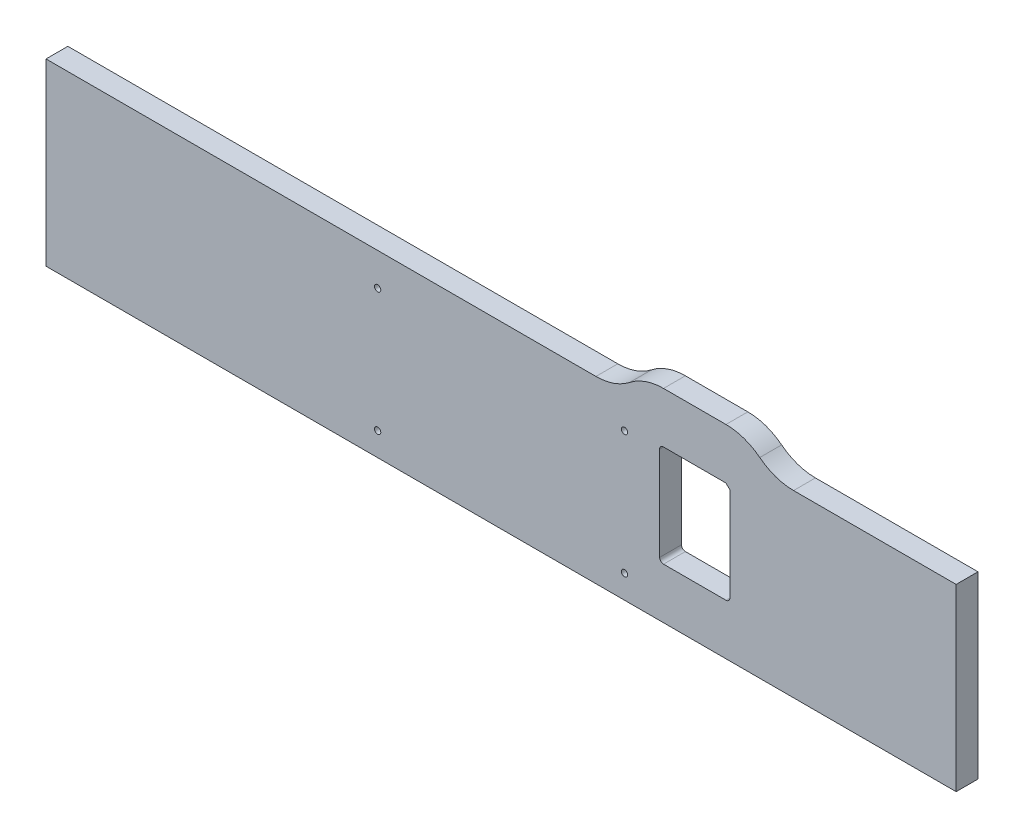
ISO-10303-21;
HEADER;
FILE_DESCRIPTION(('STEP AP214'),'2;1');
FILE_NAME('part.step','',(''),(''),'','','');
FILE_SCHEMA(('AUTOMOTIVE_DESIGN { 1 0 10303 214 1 1 1 1 }'));
ENDSEC;
DATA;
#1=APPLICATION_CONTEXT('core data for automotive mechanical design processes');
#2=APPLICATION_PROTOCOL_DEFINITION('international standard','automotive_design',2000,#1);
#3=PRODUCT_CONTEXT('',#1,'mechanical');
#4=PRODUCT('Part','Part','',(#3));
#5=PRODUCT_RELATED_PRODUCT_CATEGORY('part','',(#4));
#6=PRODUCT_DEFINITION_FORMATION('','',#4);
#7=PRODUCT_DEFINITION_CONTEXT('part definition',#1,'design');
#8=PRODUCT_DEFINITION('design','',#6,#7);
#9=PRODUCT_DEFINITION_SHAPE('','',#8);
#10=(LENGTH_UNIT() NAMED_UNIT(*) SI_UNIT(.MILLI.,.METRE.));
#11=(NAMED_UNIT(*) PLANE_ANGLE_UNIT() SI_UNIT($,.RADIAN.));
#12=(NAMED_UNIT(*) SI_UNIT($,.STERADIAN.) SOLID_ANGLE_UNIT());
#13=UNCERTAINTY_MEASURE_WITH_UNIT(LENGTH_MEASURE(1.E-05),#10,'distance_accuracy_value','');
#14=(GEOMETRIC_REPRESENTATION_CONTEXT(3) GLOBAL_UNCERTAINTY_ASSIGNED_CONTEXT((#13)) GLOBAL_UNIT_ASSIGNED_CONTEXT((#10,
#11,#12)) REPRESENTATION_CONTEXT('',''));
#15=CARTESIAN_POINT('',(0.,0.,0.));
#16=DIRECTION('',(0.,0.,1.));
#17=DIRECTION('',(1.,0.,0.));
#18=AXIS2_PLACEMENT_3D('',#15,#16,#17);
#19=CARTESIAN_POINT('',(137.160000000189,-5867.40000000055,-17.78));
#20=DIRECTION('',(1.,0.,0.));
#21=DIRECTION('',(0.,0.,-1.));
#22=AXIS2_PLACEMENT_3D('',#19,#20,#21);
#23=PLANE('',#22);
#24=DIRECTION('',(0.,1.,0.));
#25=VECTOR('',#24,1.);
#26=CARTESIAN_POINT('',(137.160000000189,-5867.40000000055,0.));
#27=LINE('',#26,#25);
#28=CARTESIAN_POINT('',(137.160000000189,-6013.45000000055,0.));
#29=VERTEX_POINT('',#28);
#30=CARTESIAN_POINT('',(137.160000000189,-5867.40000000055,0.));
#31=VERTEX_POINT('',#30);
#32=EDGE_CURVE('E232',#29,#31,#27,.T.);
#33=ORIENTED_EDGE('',*,*,#32,.F.);
#34=DIRECTION('',(0.,0.,1.));
#35=VECTOR('',#34,1.);
#36=CARTESIAN_POINT('',(137.160000000189,-6013.45000000055,-17.78));
#37=LINE('',#36,#35);
#38=CARTESIAN_POINT('',(137.160000000189,-6013.45000000055,-17.78));
#39=VERTEX_POINT('',#38);
#40=EDGE_CURVE('E11',#39,#29,#37,.T.);
#41=ORIENTED_EDGE('',*,*,#40,.F.);
#42=DIRECTION('',(0.,1.,0.));
#43=VECTOR('',#42,1.);
#44=CARTESIAN_POINT('',(137.160000000189,-5867.40000000055,-17.78));
#45=LINE('',#44,#43);
#46=CARTESIAN_POINT('',(137.160000000189,-5867.40000000055,-17.78));
#47=VERTEX_POINT('',#46);
#48=EDGE_CURVE('E233',#39,#47,#45,.T.);
#49=ORIENTED_EDGE('',*,*,#48,.T.);
#50=DIRECTION('',(0.,0.,1.));
#51=VECTOR('',#50,1.);
#52=CARTESIAN_POINT('',(137.160000000189,-5867.40000000055,-17.78));
#53=LINE('',#52,#51);
#54=EDGE_CURVE('E34',#47,#31,#53,.T.);
#55=ORIENTED_EDGE('',*,*,#54,.T.);
#56=EDGE_LOOP('',(#33,#41,#49,#55));
#57=FACE_BOUND('',#56,.T.);
#58=ADVANCED_FACE('F31',(#57),#23,.T.);
#59=CARTESIAN_POINT('',(137.160000000189,-6013.45000000055,-17.78));
#60=DIRECTION('',(0.,-1.,0.));
#61=DIRECTION('',(0.,0.,-1.));
#62=AXIS2_PLACEMENT_3D('',#59,#60,#61);
#63=PLANE('',#62);
#64=DIRECTION('',(1.,0.,0.));
#65=VECTOR('',#64,1.);
#66=CARTESIAN_POINT('',(137.160000000189,-6013.45000000055,0.));
#67=LINE('',#66,#65);
#68=CARTESIAN_POINT('',(-603.249999999811,-6013.45000000055,0.));
#69=VERTEX_POINT('',#68);
#70=EDGE_CURVE('E237',#69,#29,#67,.T.);
#71=ORIENTED_EDGE('',*,*,#70,.F.);
#72=DIRECTION('',(0.,0.,1.));
#73=VECTOR('',#72,1.);
#74=CARTESIAN_POINT('',(-603.249999999811,-6013.45000000055,-17.78));
#75=LINE('',#74,#73);
#76=CARTESIAN_POINT('',(-603.249999999811,-6013.45000000055,-17.78));
#77=VERTEX_POINT('',#76);
#78=EDGE_CURVE('E39',#77,#69,#75,.T.);
#79=ORIENTED_EDGE('',*,*,#78,.F.);
#80=DIRECTION('',(1.,0.,0.));
#81=VECTOR('',#80,1.);
#82=CARTESIAN_POINT('',(137.160000000189,-6013.45000000055,-17.78));
#83=LINE('',#82,#81);
#84=EDGE_CURVE('E261',#77,#39,#83,.T.);
#85=ORIENTED_EDGE('',*,*,#84,.T.);
#86=ORIENTED_EDGE('',*,*,#40,.T.);
#87=EDGE_LOOP('',(#71,#79,#85,#86));
#88=FACE_BOUND('',#87,.T.);
#89=ADVANCED_FACE('F317',(#88),#63,.T.);
#90=CARTESIAN_POINT('',(-603.249999999811,-6013.45000000055,-17.78));
#91=DIRECTION('',(-1.,0.,0.));
#92=DIRECTION('',(0.,0.,1.));
#93=AXIS2_PLACEMENT_3D('',#90,#91,#92);
#94=PLANE('',#93);
#95=DIRECTION('',(0.,-1.,0.));
#96=VECTOR('',#95,1.);
#97=CARTESIAN_POINT('',(-603.249999999811,-6013.45000000055,0.));
#98=LINE('',#97,#96);
#99=CARTESIAN_POINT('',(-603.249999999811,-5867.40000000055,0.));
#100=VERTEX_POINT('',#99);
#101=EDGE_CURVE('E287',#100,#69,#98,.T.);
#102=ORIENTED_EDGE('',*,*,#101,.F.);
#103=DIRECTION('',(0.,0.,1.));
#104=VECTOR('',#103,1.);
#105=CARTESIAN_POINT('',(-603.249999999811,-5867.40000000055,-17.78));
#106=LINE('',#105,#104);
#107=CARTESIAN_POINT('',(-603.249999999811,-5867.40000000055,-17.78));
#108=VERTEX_POINT('',#107);
#109=EDGE_CURVE('E293',#108,#100,#106,.T.);
#110=ORIENTED_EDGE('',*,*,#109,.F.);
#111=DIRECTION('',(0.,-1.,0.));
#112=VECTOR('',#111,1.);
#113=CARTESIAN_POINT('',(-603.249999999811,-6013.45000000055,-17.78));
#114=LINE('',#113,#112);
#115=EDGE_CURVE('E258',#108,#77,#114,.T.);
#116=ORIENTED_EDGE('',*,*,#115,.T.);
#117=ORIENTED_EDGE('',*,*,#78,.T.);
#118=EDGE_LOOP('',(#102,#110,#116,#117));
#119=FACE_BOUND('',#118,.T.);
#120=ADVANCED_FACE('F346',(#119),#94,.T.);
#121=CARTESIAN_POINT('',(-603.249999999811,-5867.40000000055,-17.78));
#122=DIRECTION('',(0.,1.,0.));
#123=DIRECTION('',(0.,0.,1.));
#124=AXIS2_PLACEMENT_3D('',#121,#122,#123);
#125=PLANE('',#124);
#126=DIRECTION('',(-1.,0.,0.));
#127=VECTOR('',#126,1.);
#128=CARTESIAN_POINT('',(-603.249999999811,-5867.40000000055,0.));
#129=LINE('',#128,#127);
#130=CARTESIAN_POINT('',(-155.878238141111,-5867.40000000055,0.));
#131=VERTEX_POINT('',#130);
#132=EDGE_CURVE('E284',#131,#100,#129,.T.);
#133=ORIENTED_EDGE('',*,*,#132,.F.);
#134=DIRECTION('',(0.,0.,1.));
#135=VECTOR('',#134,1.);
#136=CARTESIAN_POINT('',(-155.878238141111,-5867.40000000055,-17.78));
#137=LINE('',#136,#135);
#138=CARTESIAN_POINT('',(-155.878238141111,-5867.40000000055,-17.78));
#139=VERTEX_POINT('',#138);
#140=EDGE_CURVE('E295',#139,#131,#137,.T.);
#141=ORIENTED_EDGE('',*,*,#140,.F.);
#142=DIRECTION('',(-1.,0.,0.));
#143=VECTOR('',#142,1.);
#144=CARTESIAN_POINT('',(-603.249999999811,-5867.40000000055,-17.78));
#145=LINE('',#144,#143);
#146=EDGE_CURVE('E255',#139,#108,#145,.T.);
#147=ORIENTED_EDGE('',*,*,#146,.T.);
#148=ORIENTED_EDGE('',*,*,#109,.T.);
#149=EDGE_LOOP('',(#133,#141,#147,#148));
#150=FACE_BOUND('',#149,.T.);
#151=ADVANCED_FACE('F344',(#150),#125,.T.);
#152=CARTESIAN_POINT('',(-155.878238141111,-5822.95000000024,-17.78));
#153=DIRECTION('',(0.,0.,1.));
#154=DIRECTION('',(1.,0.,0.));
#155=AXIS2_PLACEMENT_3D('',#152,#153,#154);
#156=CYLINDRICAL_SURFACE('',#155,44.4500000003067);
#157=CARTESIAN_POINT('',(-155.878238141111,-5822.95000000024,0.));
#158=DIRECTION('',(0.,0.,-1.));
#159=DIRECTION('',(1.,0.,0.));
#160=AXIS2_PLACEMENT_3D('',#157,#158,#159);
#161=CIRCLE('',#160,44.4500000003067);
#162=CARTESIAN_POINT('',(-128.381931570133,-5857.87499999998,0.));
#163=VERTEX_POINT('',#162);
#164=EDGE_CURVE('E281',#163,#131,#161,.T.);
#165=ORIENTED_EDGE('',*,*,#164,.F.);
#166=DIRECTION('',(0.,0.,1.));
#167=VECTOR('',#166,1.);
#168=CARTESIAN_POINT('',(-128.381931570133,-5857.87499999998,-17.78));
#169=LINE('',#168,#167);
#170=CARTESIAN_POINT('',(-128.381931570133,-5857.87499999998,-17.78));
#171=VERTEX_POINT('',#170);
#172=EDGE_CURVE('E297',#171,#163,#169,.T.);
#173=ORIENTED_EDGE('',*,*,#172,.F.);
#174=CARTESIAN_POINT('',(-155.878238141111,-5822.95000000024,-17.78));
#175=DIRECTION('',(0.,0.,-1.));
#176=DIRECTION('',(1.,0.,0.));
#177=AXIS2_PLACEMENT_3D('',#174,#175,#176);
#178=CIRCLE('',#177,44.4500000003067);
#179=EDGE_CURVE('E252',#171,#139,#178,.T.);
#180=ORIENTED_EDGE('',*,*,#179,.T.);
#181=ORIENTED_EDGE('',*,*,#140,.T.);
#182=EDGE_LOOP('',(#165,#173,#180,#181));
#183=FACE_BOUND('',#182,.T.);
#184=ADVANCED_FACE('F340',(#183),#156,.F.);
#185=CARTESIAN_POINT('',(-100.885625,-5892.8,-17.78));
#186=DIRECTION('',(0.,0.,1.));
#187=DIRECTION('',(1.,0.,0.));
#188=AXIS2_PLACEMENT_3D('',#185,#186,#187);
#189=CYLINDRICAL_SURFACE('',#188,44.4500000000012);
#190=CARTESIAN_POINT('',(-100.885625,-5892.8,0.));
#191=DIRECTION('',(0.,0.,1.));
#192=DIRECTION('',(-1.,0.,0.));
#193=AXIS2_PLACEMENT_3D('',#190,#191,#192);
#194=CIRCLE('',#193,44.4500000000012);
#195=CARTESIAN_POINT('',(-100.885625,-5848.35,0.));
#196=VERTEX_POINT('',#195);
#197=EDGE_CURVE('E278',#196,#163,#194,.T.);
#198=ORIENTED_EDGE('',*,*,#197,.F.);
#199=DIRECTION('',(0.,0.,1.));
#200=VECTOR('',#199,1.);
#201=CARTESIAN_POINT('',(-100.885625,-5848.35,-17.78));
#202=LINE('',#201,#200);
#203=CARTESIAN_POINT('',(-100.885625,-5848.35,-17.78));
#204=VERTEX_POINT('',#203);
#205=EDGE_CURVE('E299',#204,#196,#202,.T.);
#206=ORIENTED_EDGE('',*,*,#205,.F.);
#207=CARTESIAN_POINT('',(-100.885625,-5892.8,-17.78));
#208=DIRECTION('',(0.,0.,1.));
#209=DIRECTION('',(-1.,0.,0.));
#210=AXIS2_PLACEMENT_3D('',#207,#208,#209);
#211=CIRCLE('',#210,44.4500000000012);
#212=EDGE_CURVE('E249',#204,#171,#211,.T.);
#213=ORIENTED_EDGE('',*,*,#212,.T.);
#214=ORIENTED_EDGE('',*,*,#172,.T.);
#215=EDGE_LOOP('',(#198,#206,#213,#214));
#216=FACE_BOUND('',#215,.T.);
#217=ADVANCED_FACE('F336',(#216),#189,.T.);
#218=CARTESIAN_POINT('',(-100.885625,-5848.35,-17.78));
#219=DIRECTION('',(0.,1.,0.));
#220=DIRECTION('',(0.,0.,1.));
#221=AXIS2_PLACEMENT_3D('',#218,#219,#220);
#222=PLANE('',#221);
#223=DIRECTION('',(-1.,0.,0.));
#224=VECTOR('',#223,1.);
#225=CARTESIAN_POINT('',(-100.885625,-5848.35,0.));
#226=LINE('',#225,#224);
#227=CARTESIAN_POINT('',(-50.085625,-5848.35,0.));
#228=VERTEX_POINT('',#227);
#229=EDGE_CURVE('E275',#228,#196,#226,.T.);
#230=ORIENTED_EDGE('',*,*,#229,.F.);
#231=DIRECTION('',(0.,0.,1.));
#232=VECTOR('',#231,1.);
#233=CARTESIAN_POINT('',(-50.085625,-5848.35,-17.78));
#234=LINE('',#233,#232);
#235=CARTESIAN_POINT('',(-50.085625,-5848.35,-17.78));
#236=VERTEX_POINT('',#235);
#237=EDGE_CURVE('E301',#236,#228,#234,.T.);
#238=ORIENTED_EDGE('',*,*,#237,.F.);
#239=DIRECTION('',(-1.,0.,0.));
#240=VECTOR('',#239,1.);
#241=CARTESIAN_POINT('',(-100.885625,-5848.35,-17.78));
#242=LINE('',#241,#240);
#243=EDGE_CURVE('E246',#236,#204,#242,.T.);
#244=ORIENTED_EDGE('',*,*,#243,.T.);
#245=ORIENTED_EDGE('',*,*,#205,.T.);
#246=EDGE_LOOP('',(#230,#238,#244,#245));
#247=FACE_BOUND('',#246,.T.);
#248=ADVANCED_FACE('F332',(#247),#222,.T.);
#249=CARTESIAN_POINT('',(-50.085625,-5892.8,-17.78));
#250=DIRECTION('',(0.,0.,1.));
#251=DIRECTION('',(1.,0.,0.));
#252=AXIS2_PLACEMENT_3D('',#249,#250,#251);
#253=CYLINDRICAL_SURFACE('',#252,44.450000000002);
#254=CARTESIAN_POINT('',(-50.085625,-5892.8,0.));
#255=DIRECTION('',(0.,0.,1.));
#256=DIRECTION('',(-1.,0.,0.));
#257=AXIS2_PLACEMENT_3D('',#254,#255,#256);
#258=CIRCLE('',#257,44.450000000002);
#259=CARTESIAN_POINT('',(-22.5893184298673,-5857.87499999998,0.));
#260=VERTEX_POINT('',#259);
#261=EDGE_CURVE('E272',#260,#228,#258,.T.);
#262=ORIENTED_EDGE('',*,*,#261,.F.);
#263=DIRECTION('',(0.,0.,1.));
#264=VECTOR('',#263,1.);
#265=CARTESIAN_POINT('',(-22.5893184298673,-5857.87499999998,-17.78));
#266=LINE('',#265,#264);
#267=CARTESIAN_POINT('',(-22.5893184298673,-5857.87499999998,-17.78));
#268=VERTEX_POINT('',#267);
#269=EDGE_CURVE('E303',#268,#260,#266,.T.);
#270=ORIENTED_EDGE('',*,*,#269,.F.);
#271=CARTESIAN_POINT('',(-50.085625,-5892.8,-17.78));
#272=DIRECTION('',(0.,0.,1.));
#273=DIRECTION('',(-1.,0.,0.));
#274=AXIS2_PLACEMENT_3D('',#271,#272,#273);
#275=CIRCLE('',#274,44.450000000002);
#276=EDGE_CURVE('E243',#268,#236,#275,.T.);
#277=ORIENTED_EDGE('',*,*,#276,.T.);
#278=ORIENTED_EDGE('',*,*,#237,.T.);
#279=EDGE_LOOP('',(#262,#270,#277,#278));
#280=FACE_BOUND('',#279,.T.);
#281=ADVANCED_FACE('F330',(#280),#253,.T.);
#282=CARTESIAN_POINT('',(4.90698814194757,-5822.94999999782,-17.78));
#283=DIRECTION('',(0.,0.,1.));
#284=DIRECTION('',(1.,0.,0.));
#285=AXIS2_PLACEMENT_3D('',#282,#283,#284);
#286=CYLINDRICAL_SURFACE('',#285,44.4500000027208);
#287=CARTESIAN_POINT('',(4.90698814194757,-5822.94999999782,0.));
#288=DIRECTION('',(0.,0.,-1.));
#289=DIRECTION('',(1.,0.,0.));
#290=AXIS2_PLACEMENT_3D('',#287,#288,#289);
#291=CIRCLE('',#290,44.4500000027208);
#292=CARTESIAN_POINT('',(4.90698814111107,-5867.40000000055,0.));
#293=VERTEX_POINT('',#292);
#294=EDGE_CURVE('E269',#293,#260,#291,.T.);
#295=ORIENTED_EDGE('',*,*,#294,.F.);
#296=DIRECTION('',(0.,0.,1.));
#297=VECTOR('',#296,1.);
#298=CARTESIAN_POINT('',(4.90698814111107,-5867.40000000055,-17.78));
#299=LINE('',#298,#297);
#300=CARTESIAN_POINT('',(4.90698814111107,-5867.40000000055,-17.78));
#301=VERTEX_POINT('',#300);
#302=EDGE_CURVE('E304',#301,#293,#299,.T.);
#303=ORIENTED_EDGE('',*,*,#302,.F.);
#304=CARTESIAN_POINT('',(4.90698814194757,-5822.94999999782,-17.78));
#305=DIRECTION('',(0.,0.,-1.));
#306=DIRECTION('',(1.,0.,0.));
#307=AXIS2_PLACEMENT_3D('',#304,#305,#306);
#308=CIRCLE('',#307,44.4500000027208);
#309=EDGE_CURVE('E240',#301,#268,#308,.T.);
#310=ORIENTED_EDGE('',*,*,#309,.T.);
#311=ORIENTED_EDGE('',*,*,#269,.T.);
#312=EDGE_LOOP('',(#295,#303,#310,#311));
#313=FACE_BOUND('',#312,.T.);
#314=ADVANCED_FACE('F326',(#313),#286,.F.);
#315=CARTESIAN_POINT('',(4.90698814111106,-5867.40000000055,-17.78));
#316=DIRECTION('',(0.,1.,0.));
#317=DIRECTION('',(0.,0.,1.));
#318=AXIS2_PLACEMENT_3D('',#315,#316,#317);
#319=PLANE('',#318);
#320=DIRECTION('',(-1.,0.,0.));
#321=VECTOR('',#320,1.);
#322=CARTESIAN_POINT('',(4.90698814111106,-5867.40000000055,0.));
#323=LINE('',#322,#321);
#324=EDGE_CURVE('E266',#31,#293,#323,.T.);
#325=ORIENTED_EDGE('',*,*,#324,.F.);
#326=ORIENTED_EDGE('',*,*,#54,.F.);
#327=DIRECTION('',(-1.,0.,0.));
#328=VECTOR('',#327,1.);
#329=CARTESIAN_POINT('',(4.90698814111106,-5867.40000000055,-17.78));
#330=LINE('',#329,#328);
#331=EDGE_CURVE('E236',#47,#301,#330,.T.);
#332=ORIENTED_EDGE('',*,*,#331,.T.);
#333=ORIENTED_EDGE('',*,*,#302,.T.);
#334=EDGE_LOOP('',(#325,#326,#332,#333));
#335=FACE_BOUND('',#334,.T.);
#336=ADVANCED_FACE('F312',(#335),#319,.T.);
#337=CARTESIAN_POINT('',(-155.878238141111,-5822.95000000024,-17.78));
#338=DIRECTION('',(0.,0.,1.));
#339=DIRECTION('',(1.,0.,0.));
#340=AXIS2_PLACEMENT_3D('',#337,#338,#339);
#341=PLANE('',#340);
#342=DIRECTION('',(1.,0.,0.));
#343=VECTOR('',#342,1.);
#344=CARTESIAN_POINT('',(-50.085625,-5889.625,-17.78));
#345=LINE('',#344,#343);
#346=CARTESIAN_POINT('',(-100.885625,-5889.625,-17.78));
#347=VERTEX_POINT('',#346);
#348=CARTESIAN_POINT('',(-50.0856249999997,-5889.625,-17.78));
#349=VERTEX_POINT('',#348);
#350=EDGE_CURVE('E571',#347,#349,#345,.T.);
#351=ORIENTED_EDGE('',*,*,#350,.F.);
#352=CARTESIAN_POINT('',(-100.885625,-5892.8,-17.78));
#353=DIRECTION('',(0.,0.,1.));
#354=DIRECTION('',(1.,0.,0.));
#355=AXIS2_PLACEMENT_3D('',#352,#353,#354);
#356=CIRCLE('',#355,3.1750000000003);
#357=CARTESIAN_POINT('',(-104.060625,-5892.8,-17.78));
#358=VERTEX_POINT('',#357);
#359=EDGE_CURVE('E208',#358,#347,#356,.F.);
#360=ORIENTED_EDGE('',*,*,#359,.F.);
#361=DIRECTION('',(0.,1.,0.));
#362=VECTOR('',#361,1.);
#363=CARTESIAN_POINT('',(-104.060625,-5892.8,-17.78));
#364=LINE('',#363,#362);
#365=CARTESIAN_POINT('',(-104.060625,-5969.,-17.78));
#366=VERTEX_POINT('',#365);
#367=EDGE_CURVE('E205',#366,#358,#364,.T.);
#368=ORIENTED_EDGE('',*,*,#367,.F.);
#369=CARTESIAN_POINT('',(-100.885624999999,-5969.,-17.78));
#370=DIRECTION('',(0.,0.,1.));
#371=DIRECTION('',(1.,0.,0.));
#372=AXIS2_PLACEMENT_3D('',#369,#370,#371);
#373=CIRCLE('',#372,3.17500000000059);
#374=CARTESIAN_POINT('',(-100.885625,-5972.175,-17.78));
#375=VERTEX_POINT('',#374);
#376=EDGE_CURVE('E162',#375,#366,#373,.F.);
#377=ORIENTED_EDGE('',*,*,#376,.F.);
#378=DIRECTION('',(-1.,0.,0.));
#379=VECTOR('',#378,1.);
#380=CARTESIAN_POINT('',(-100.885625,-5972.175,-17.78));
#381=LINE('',#380,#379);
#382=CARTESIAN_POINT('',(-50.085625,-5972.175,-17.78));
#383=VERTEX_POINT('',#382);
#384=EDGE_CURVE('E557',#383,#375,#381,.T.);
#385=ORIENTED_EDGE('',*,*,#384,.F.);
#386=CARTESIAN_POINT('',(-50.085625,-5969.,-17.78));
#387=DIRECTION('',(0.,0.,1.));
#388=DIRECTION('',(1.,0.,0.));
#389=AXIS2_PLACEMENT_3D('',#386,#387,#388);
#390=CIRCLE('',#389,3.17499999999986);
#391=CARTESIAN_POINT('',(-46.9106250000002,-5969.,-17.78));
#392=VERTEX_POINT('',#391);
#393=EDGE_CURVE('E559',#392,#383,#390,.F.);
#394=ORIENTED_EDGE('',*,*,#393,.F.);
#395=DIRECTION('',(0.,-1.,0.));
#396=VECTOR('',#395,1.);
#397=CARTESIAN_POINT('',(-46.910625,-5969.,-17.78));
#398=LINE('',#397,#396);
#399=CARTESIAN_POINT('',(-46.910625,-5892.8,-17.78));
#400=VERTEX_POINT('',#399);
#401=EDGE_CURVE('E567',#400,#392,#398,.T.);
#402=ORIENTED_EDGE('',*,*,#401,.F.);
#403=DIRECTION('',(0.707106781186581,-0.707106781186514,0.));
#404=VECTOR('',#403,1.);
#405=CARTESIAN_POINT('',(-46.910625,-5892.8,-17.78));
#406=LINE('',#405,#404);
#407=EDGE_CURVE('E569',#349,#400,#406,.T.);
#408=ORIENTED_EDGE('',*,*,#407,.F.);
#409=EDGE_LOOP('',(#351,#360,#368,#377,#385,#394,#402,#408));
#410=FACE_BOUND('',#409,.T.);
#411=CARTESIAN_POINT('',(-333.454375,-5894.07,-17.78));
#412=DIRECTION('',(0.,0.,1.));
#413=DIRECTION('',(1.,0.,0.));
#414=AXIS2_PLACEMENT_3D('',#411,#412,#413);
#415=CIRCLE('',#414,2.54000000000009);
#416=CARTESIAN_POINT('',(-330.914375,-5894.07,-17.78));
#417=VERTEX_POINT('',#416);
#418=EDGE_CURVE('E211',#417,#417,#415,.F.);
#419=ORIENTED_EDGE('',*,*,#418,.F.);
#420=EDGE_LOOP('',(#419));
#421=FACE_BOUND('',#420,.T.);
#422=CARTESIAN_POINT('',(-132.635625,-5894.07,-17.78));
#423=DIRECTION('',(0.,0.,1.));
#424=DIRECTION('',(1.,0.,0.));
#425=AXIS2_PLACEMENT_3D('',#422,#423,#424);
#426=CIRCLE('',#425,2.5399999999999);
#427=CARTESIAN_POINT('',(-130.095625,-5894.07,-17.78));
#428=VERTEX_POINT('',#427);
#429=EDGE_CURVE('E217',#428,#428,#426,.F.);
#430=ORIENTED_EDGE('',*,*,#429,.F.);
#431=EDGE_LOOP('',(#430));
#432=FACE_BOUND('',#431,.T.);
#433=CARTESIAN_POINT('',(-132.635625,-5994.4,-17.78));
#434=DIRECTION('',(0.,0.,1.));
#435=DIRECTION('',(1.,0.,0.));
#436=AXIS2_PLACEMENT_3D('',#433,#434,#435);
#437=CIRCLE('',#436,2.53999999999974);
#438=CARTESIAN_POINT('',(-130.095625,-5994.4,-17.78));
#439=VERTEX_POINT('',#438);
#440=EDGE_CURVE('E223',#439,#439,#437,.F.);
#441=ORIENTED_EDGE('',*,*,#440,.F.);
#442=EDGE_LOOP('',(#441));
#443=FACE_BOUND('',#442,.T.);
#444=CARTESIAN_POINT('',(-333.454375,-5994.4,-17.78));
#445=DIRECTION('',(0.,0.,1.));
#446=DIRECTION('',(1.,0.,0.));
#447=AXIS2_PLACEMENT_3D('',#444,#445,#446);
#448=CIRCLE('',#447,2.53999999999993);
#449=CARTESIAN_POINT('',(-330.914375,-5994.4,-17.78));
#450=VERTEX_POINT('',#449);
#451=EDGE_CURVE('E229',#450,#450,#448,.F.);
#452=ORIENTED_EDGE('',*,*,#451,.F.);
#453=EDGE_LOOP('',(#452));
#454=FACE_BOUND('',#453,.T.);
#455=ORIENTED_EDGE('',*,*,#48,.F.);
#456=ORIENTED_EDGE('',*,*,#84,.F.);
#457=ORIENTED_EDGE('',*,*,#115,.F.);
#458=ORIENTED_EDGE('',*,*,#146,.F.);
#459=ORIENTED_EDGE('',*,*,#179,.F.);
#460=ORIENTED_EDGE('',*,*,#212,.F.);
#461=ORIENTED_EDGE('',*,*,#243,.F.);
#462=ORIENTED_EDGE('',*,*,#276,.F.);
#463=ORIENTED_EDGE('',*,*,#309,.F.);
#464=ORIENTED_EDGE('',*,*,#331,.F.);
#465=EDGE_LOOP('',(#455,#456,#457,#458,#459,#460,#461,#462,#463,#464));
#466=FACE_BOUND('',#465,.T.);
#467=ADVANCED_FACE('F320',(#410,#421,#432,#443,#454,#466),#341,.F.);
#468=CARTESIAN_POINT('',(-155.878238141111,-5822.95000000024,0.));
#469=DIRECTION('',(0.,0.,1.));
#470=DIRECTION('',(1.,0.,0.));
#471=AXIS2_PLACEMENT_3D('',#468,#469,#470);
#472=PLANE('',#471);
#473=CARTESIAN_POINT('',(-100.885625,-5892.8,0.));
#474=DIRECTION('',(0.,0.,1.));
#475=DIRECTION('',(1.,0.,0.));
#476=AXIS2_PLACEMENT_3D('',#473,#474,#475);
#477=CIRCLE('',#476,3.1750000000003);
#478=CARTESIAN_POINT('',(-100.885625,-5889.625,0.));
#479=VERTEX_POINT('',#478);
#480=CARTESIAN_POINT('',(-104.060625,-5892.8,0.));
#481=VERTEX_POINT('',#480);
#482=EDGE_CURVE('E55',#479,#481,#477,.T.);
#483=ORIENTED_EDGE('',*,*,#482,.F.);
#484=DIRECTION('',(-1.,0.,0.));
#485=VECTOR('',#484,1.);
#486=CARTESIAN_POINT('',(-50.085625,-5889.625,0.));
#487=LINE('',#486,#485);
#488=CARTESIAN_POINT('',(-50.085625,-5889.625,0.));
#489=VERTEX_POINT('',#488);
#490=EDGE_CURVE('E190',#489,#479,#487,.T.);
#491=ORIENTED_EDGE('',*,*,#490,.F.);
#492=DIRECTION('',(-0.707106781186581,0.707106781186514,0.));
#493=VECTOR('',#492,1.);
#494=CARTESIAN_POINT('',(-46.910625,-5892.8,0.));
#495=LINE('',#494,#493);
#496=CARTESIAN_POINT('',(-46.910625,-5892.8,0.));
#497=VERTEX_POINT('',#496);
#498=EDGE_CURVE('E187',#497,#489,#495,.T.);
#499=ORIENTED_EDGE('',*,*,#498,.F.);
#500=DIRECTION('',(0.,1.,0.));
#501=VECTOR('',#500,1.);
#502=CARTESIAN_POINT('',(-46.910625,-5969.,0.));
#503=LINE('',#502,#501);
#504=CARTESIAN_POINT('',(-46.9106250000002,-5969.,0.));
#505=VERTEX_POINT('',#504);
#506=EDGE_CURVE('E184',#505,#497,#503,.T.);
#507=ORIENTED_EDGE('',*,*,#506,.F.);
#508=CARTESIAN_POINT('',(-50.085625,-5969.,0.));
#509=DIRECTION('',(0.,0.,1.));
#510=DIRECTION('',(1.,0.,0.));
#511=AXIS2_PLACEMENT_3D('',#508,#509,#510);
#512=CIRCLE('',#511,3.17499999999986);
#513=CARTESIAN_POINT('',(-50.085625,-5972.175,0.));
#514=VERTEX_POINT('',#513);
#515=EDGE_CURVE('E178',#514,#505,#512,.T.);
#516=ORIENTED_EDGE('',*,*,#515,.F.);
#517=DIRECTION('',(1.,0.,0.));
#518=VECTOR('',#517,1.);
#519=CARTESIAN_POINT('',(-100.885625,-5972.175,0.));
#520=LINE('',#519,#518);
#521=CARTESIAN_POINT('',(-100.885625,-5972.175,0.));
#522=VERTEX_POINT('',#521);
#523=EDGE_CURVE('E176',#522,#514,#520,.T.);
#524=ORIENTED_EDGE('',*,*,#523,.F.);
#525=CARTESIAN_POINT('',(-100.885624999999,-5969.,0.));
#526=DIRECTION('',(0.,0.,1.));
#527=DIRECTION('',(1.,0.,0.));
#528=AXIS2_PLACEMENT_3D('',#525,#526,#527);
#529=CIRCLE('',#528,3.17500000000059);
#530=CARTESIAN_POINT('',(-104.060625,-5969.,0.));
#531=VERTEX_POINT('',#530);
#532=EDGE_CURVE('E159',#531,#522,#529,.T.);
#533=ORIENTED_EDGE('',*,*,#532,.F.);
#534=DIRECTION('',(0.,-1.,0.));
#535=VECTOR('',#534,1.);
#536=CARTESIAN_POINT('',(-104.060625,-5892.8,0.));
#537=LINE('',#536,#535);
#538=EDGE_CURVE('E168',#481,#531,#537,.T.);
#539=ORIENTED_EDGE('',*,*,#538,.F.);
#540=EDGE_LOOP('',(#483,#491,#499,#507,#516,#524,#533,#539));
#541=FACE_BOUND('',#540,.T.);
#542=CARTESIAN_POINT('',(-333.454375,-5894.07,0.));
#543=DIRECTION('',(0.,0.,1.));
#544=DIRECTION('',(1.,0.,0.));
#545=AXIS2_PLACEMENT_3D('',#542,#543,#544);
#546=CIRCLE('',#545,2.54000000000009);
#547=CARTESIAN_POINT('',(-330.914375,-5894.07,0.));
#548=VERTEX_POINT('',#547);
#549=EDGE_CURVE('E207',#548,#548,#546,.T.);
#550=ORIENTED_EDGE('',*,*,#549,.F.);
#551=EDGE_LOOP('',(#550));
#552=FACE_BOUND('',#551,.T.);
#553=CARTESIAN_POINT('',(-132.635625,-5894.07,0.));
#554=DIRECTION('',(0.,0.,1.));
#555=DIRECTION('',(1.,0.,0.));
#556=AXIS2_PLACEMENT_3D('',#553,#554,#555);
#557=CIRCLE('',#556,2.5399999999999);
#558=CARTESIAN_POINT('',(-130.095625,-5894.07,0.));
#559=VERTEX_POINT('',#558);
#560=EDGE_CURVE('E214',#559,#559,#557,.T.);
#561=ORIENTED_EDGE('',*,*,#560,.F.);
#562=EDGE_LOOP('',(#561));
#563=FACE_BOUND('',#562,.T.);
#564=CARTESIAN_POINT('',(-132.635625,-5994.4,0.));
#565=DIRECTION('',(0.,0.,1.));
#566=DIRECTION('',(1.,0.,0.));
#567=AXIS2_PLACEMENT_3D('',#564,#565,#566);
#568=CIRCLE('',#567,2.53999999999974);
#569=CARTESIAN_POINT('',(-130.095625,-5994.4,0.));
#570=VERTEX_POINT('',#569);
#571=EDGE_CURVE('E220',#570,#570,#568,.T.);
#572=ORIENTED_EDGE('',*,*,#571,.F.);
#573=EDGE_LOOP('',(#572));
#574=FACE_BOUND('',#573,.T.);
#575=CARTESIAN_POINT('',(-333.454375,-5994.4,0.));
#576=DIRECTION('',(0.,0.,1.));
#577=DIRECTION('',(1.,0.,0.));
#578=AXIS2_PLACEMENT_3D('',#575,#576,#577);
#579=CIRCLE('',#578,2.53999999999993);
#580=CARTESIAN_POINT('',(-330.914375,-5994.4,0.));
#581=VERTEX_POINT('',#580);
#582=EDGE_CURVE('E226',#581,#581,#579,.T.);
#583=ORIENTED_EDGE('',*,*,#582,.F.);
#584=EDGE_LOOP('',(#583));
#585=FACE_BOUND('',#584,.T.);
#586=ORIENTED_EDGE('',*,*,#32,.T.);
#587=ORIENTED_EDGE('',*,*,#324,.T.);
#588=ORIENTED_EDGE('',*,*,#294,.T.);
#589=ORIENTED_EDGE('',*,*,#261,.T.);
#590=ORIENTED_EDGE('',*,*,#229,.T.);
#591=ORIENTED_EDGE('',*,*,#197,.T.);
#592=ORIENTED_EDGE('',*,*,#164,.T.);
#593=ORIENTED_EDGE('',*,*,#132,.T.);
#594=ORIENTED_EDGE('',*,*,#101,.T.);
#595=ORIENTED_EDGE('',*,*,#70,.T.);
#596=EDGE_LOOP('',(#586,#587,#588,#589,#590,#591,#592,#593,#594,#595));
#597=FACE_BOUND('',#596,.T.);
#598=ADVANCED_FACE('F172',(#541,#552,#563,#574,#585,#597),#472,.T.);
#599=CARTESIAN_POINT('',(-333.454375,-5994.4,-118.182315710347));
#600=DIRECTION('',(0.,0.,1.));
#601=DIRECTION('',(1.,0.,0.));
#602=AXIS2_PLACEMENT_3D('',#599,#600,#601);
#603=CYLINDRICAL_SURFACE('',#602,2.53999999999993);
#604=ORIENTED_EDGE('',*,*,#451,.T.);
#605=EDGE_LOOP('',(#604));
#606=FACE_BOUND('',#605,.T.);
#607=ORIENTED_EDGE('',*,*,#582,.T.);
#608=EDGE_LOOP('',(#607));
#609=FACE_BOUND('',#608,.T.);
#610=ADVANCED_FACE('F437',(#606,#609),#603,.F.);
#611=CARTESIAN_POINT('',(-132.635625,-5994.4,-118.182315710347));
#612=DIRECTION('',(0.,0.,1.));
#613=DIRECTION('',(1.,0.,0.));
#614=AXIS2_PLACEMENT_3D('',#611,#612,#613);
#615=CYLINDRICAL_SURFACE('',#614,2.53999999999974);
#616=ORIENTED_EDGE('',*,*,#440,.T.);
#617=EDGE_LOOP('',(#616));
#618=FACE_BOUND('',#617,.T.);
#619=ORIENTED_EDGE('',*,*,#571,.T.);
#620=EDGE_LOOP('',(#619));
#621=FACE_BOUND('',#620,.T.);
#622=ADVANCED_FACE('F446',(#618,#621),#615,.F.);
#623=CARTESIAN_POINT('',(-132.635625,-5894.07,-118.182315710347));
#624=DIRECTION('',(0.,0.,1.));
#625=DIRECTION('',(1.,0.,0.));
#626=AXIS2_PLACEMENT_3D('',#623,#624,#625);
#627=CYLINDRICAL_SURFACE('',#626,2.5399999999999);
#628=ORIENTED_EDGE('',*,*,#429,.T.);
#629=EDGE_LOOP('',(#628));
#630=FACE_BOUND('',#629,.T.);
#631=ORIENTED_EDGE('',*,*,#560,.T.);
#632=EDGE_LOOP('',(#631));
#633=FACE_BOUND('',#632,.T.);
#634=ADVANCED_FACE('F456',(#630,#633),#627,.F.);
#635=CARTESIAN_POINT('',(-333.454375,-5894.07,-118.182315710347));
#636=DIRECTION('',(0.,0.,1.));
#637=DIRECTION('',(1.,0.,0.));
#638=AXIS2_PLACEMENT_3D('',#635,#636,#637);
#639=CYLINDRICAL_SURFACE('',#638,2.54000000000009);
#640=ORIENTED_EDGE('',*,*,#418,.T.);
#641=EDGE_LOOP('',(#640));
#642=FACE_BOUND('',#641,.T.);
#643=ORIENTED_EDGE('',*,*,#549,.T.);
#644=EDGE_LOOP('',(#643));
#645=FACE_BOUND('',#644,.T.);
#646=ADVANCED_FACE('F466',(#642,#645),#639,.F.);
#647=CARTESIAN_POINT('',(-100.885625,-5892.8,-118.182315710347));
#648=DIRECTION('',(0.,0.,1.));
#649=DIRECTION('',(1.,0.,0.));
#650=AXIS2_PLACEMENT_3D('',#647,#648,#649);
#651=CYLINDRICAL_SURFACE('',#650,3.1750000000003);
#652=ORIENTED_EDGE('',*,*,#359,.T.);
#653=DIRECTION('',(0.,0.,1.));
#654=VECTOR('',#653,1.);
#655=CARTESIAN_POINT('',(-100.885625,-5889.625,-118.182315710347));
#656=LINE('',#655,#654);
#657=EDGE_CURVE('E193',#347,#479,#656,.T.);
#658=ORIENTED_EDGE('',*,*,#657,.T.);
#659=ORIENTED_EDGE('',*,*,#482,.T.);
#660=DIRECTION('',(0.,0.,1.));
#661=VECTOR('',#660,1.);
#662=CARTESIAN_POINT('',(-104.060625,-5892.8,-118.182315710347));
#663=LINE('',#662,#661);
#664=EDGE_CURVE('E165',#358,#481,#663,.T.);
#665=ORIENTED_EDGE('',*,*,#664,.F.);
#666=EDGE_LOOP('',(#652,#658,#659,#665));
#667=FACE_BOUND('',#666,.T.);
#668=ADVANCED_FACE('F476',(#667),#651,.F.);
#669=CARTESIAN_POINT('',(-50.085625,-5889.625,-118.182315710347));
#670=DIRECTION('',(0.,1.,0.));
#671=DIRECTION('',(0.,0.,1.));
#672=AXIS2_PLACEMENT_3D('',#669,#670,#671);
#673=PLANE('',#672);
#674=ORIENTED_EDGE('',*,*,#350,.T.);
#675=DIRECTION('',(0.,0.,1.));
#676=VECTOR('',#675,1.);
#677=CARTESIAN_POINT('',(-50.085625,-5889.625,-118.182315710347));
#678=LINE('',#677,#676);
#679=EDGE_CURVE('E195',#349,#489,#678,.T.);
#680=ORIENTED_EDGE('',*,*,#679,.T.);
#681=ORIENTED_EDGE('',*,*,#490,.T.);
#682=ORIENTED_EDGE('',*,*,#657,.F.);
#683=EDGE_LOOP('',(#674,#680,#681,#682));
#684=FACE_BOUND('',#683,.T.);
#685=ADVANCED_FACE('F486',(#684),#673,.F.);
#686=CARTESIAN_POINT('',(-46.910625,-5892.8,-118.182315710347));
#687=DIRECTION('',(0.707106781186514,0.707106781186581,0.));
#688=DIRECTION('',(-0.707106781186581,0.707106781186514,0.));
#689=AXIS2_PLACEMENT_3D('',#686,#687,#688);
#690=PLANE('',#689);
#691=ORIENTED_EDGE('',*,*,#407,.T.);
#692=DIRECTION('',(0.,0.,1.));
#693=VECTOR('',#692,1.);
#694=CARTESIAN_POINT('',(-46.910625,-5892.8,-118.182315710347));
#695=LINE('',#694,#693);
#696=EDGE_CURVE('E197',#400,#497,#695,.T.);
#697=ORIENTED_EDGE('',*,*,#696,.T.);
#698=ORIENTED_EDGE('',*,*,#498,.T.);
#699=ORIENTED_EDGE('',*,*,#679,.F.);
#700=EDGE_LOOP('',(#691,#697,#698,#699));
#701=FACE_BOUND('',#700,.T.);
#702=ADVANCED_FACE('F495',(#701),#690,.F.);
#703=CARTESIAN_POINT('',(-46.910625,-5969.,-118.182315710347));
#704=DIRECTION('',(1.,0.,0.));
#705=DIRECTION('',(0.,0.,-1.));
#706=AXIS2_PLACEMENT_3D('',#703,#704,#705);
#707=PLANE('',#706);
#708=ORIENTED_EDGE('',*,*,#401,.T.);
#709=DIRECTION('',(0.,0.,1.));
#710=VECTOR('',#709,1.);
#711=CARTESIAN_POINT('',(-46.9106250000002,-5969.,-118.182315710347));
#712=LINE('',#711,#710);
#713=EDGE_CURVE('E199',#392,#505,#712,.T.);
#714=ORIENTED_EDGE('',*,*,#713,.T.);
#715=ORIENTED_EDGE('',*,*,#506,.T.);
#716=ORIENTED_EDGE('',*,*,#696,.F.);
#717=EDGE_LOOP('',(#708,#714,#715,#716));
#718=FACE_BOUND('',#717,.T.);
#719=ADVANCED_FACE('F505',(#718),#707,.F.);
#720=CARTESIAN_POINT('',(-50.085625,-5969.,-118.182315710347));
#721=DIRECTION('',(0.,0.,1.));
#722=DIRECTION('',(1.,0.,0.));
#723=AXIS2_PLACEMENT_3D('',#720,#721,#722);
#724=CYLINDRICAL_SURFACE('',#723,3.17499999999986);
#725=ORIENTED_EDGE('',*,*,#393,.T.);
#726=DIRECTION('',(0.,0.,1.));
#727=VECTOR('',#726,1.);
#728=CARTESIAN_POINT('',(-50.085625,-5972.175,-118.182315710347));
#729=LINE('',#728,#727);
#730=EDGE_CURVE('E201',#383,#514,#729,.T.);
#731=ORIENTED_EDGE('',*,*,#730,.T.);
#732=ORIENTED_EDGE('',*,*,#515,.T.);
#733=ORIENTED_EDGE('',*,*,#713,.F.);
#734=EDGE_LOOP('',(#725,#731,#732,#733));
#735=FACE_BOUND('',#734,.T.);
#736=ADVANCED_FACE('F515',(#735),#724,.F.);
#737=CARTESIAN_POINT('',(-100.885625,-5972.175,-118.182315710347));
#738=DIRECTION('',(0.,-1.,0.));
#739=DIRECTION('',(0.,0.,-1.));
#740=AXIS2_PLACEMENT_3D('',#737,#738,#739);
#741=PLANE('',#740);
#742=ORIENTED_EDGE('',*,*,#384,.T.);
#743=DIRECTION('',(0.,0.,1.));
#744=VECTOR('',#743,1.);
#745=CARTESIAN_POINT('',(-100.885625,-5972.175,-118.182315710347));
#746=LINE('',#745,#744);
#747=EDGE_CURVE('E164',#375,#522,#746,.T.);
#748=ORIENTED_EDGE('',*,*,#747,.T.);
#749=ORIENTED_EDGE('',*,*,#523,.T.);
#750=ORIENTED_EDGE('',*,*,#730,.F.);
#751=EDGE_LOOP('',(#742,#748,#749,#750));
#752=FACE_BOUND('',#751,.T.);
#753=ADVANCED_FACE('F525',(#752),#741,.F.);
#754=CARTESIAN_POINT('',(-100.885624999999,-5969.,-118.182315710347));
#755=DIRECTION('',(0.,0.,1.));
#756=DIRECTION('',(1.,0.,0.));
#757=AXIS2_PLACEMENT_3D('',#754,#755,#756);
#758=CYLINDRICAL_SURFACE('',#757,3.17500000000059);
#759=ORIENTED_EDGE('',*,*,#376,.T.);
#760=DIRECTION('',(0.,0.,1.));
#761=VECTOR('',#760,1.);
#762=CARTESIAN_POINT('',(-104.060625,-5969.,-118.182315710347));
#763=LINE('',#762,#761);
#764=EDGE_CURVE('E47',#366,#531,#763,.T.);
#765=ORIENTED_EDGE('',*,*,#764,.T.);
#766=ORIENTED_EDGE('',*,*,#532,.T.);
#767=ORIENTED_EDGE('',*,*,#747,.F.);
#768=EDGE_LOOP('',(#759,#765,#766,#767));
#769=FACE_BOUND('',#768,.T.);
#770=ADVANCED_FACE('F156',(#769),#758,.F.);
#771=CARTESIAN_POINT('',(-104.060625,-5892.8,-118.182315710347));
#772=DIRECTION('',(-1.,0.,0.));
#773=DIRECTION('',(0.,0.,1.));
#774=AXIS2_PLACEMENT_3D('',#771,#772,#773);
#775=PLANE('',#774);
#776=ORIENTED_EDGE('',*,*,#367,.T.);
#777=ORIENTED_EDGE('',*,*,#664,.T.);
#778=ORIENTED_EDGE('',*,*,#538,.T.);
#779=ORIENTED_EDGE('',*,*,#764,.F.);
#780=EDGE_LOOP('',(#776,#777,#778,#779));
#781=FACE_BOUND('',#780,.T.);
#782=ADVANCED_FACE('F169',(#781),#775,.F.);
#783=CLOSED_SHELL('',(#58,#89,#120,#151,#184,#217,#248,#281,#314,#336,#467,#598,#610,#622,#634,
#646,#668,#685,#702,#719,#736,#753,#770,#782));
#784=MANIFOLD_SOLID_BREP('B2',#783);
#785=ADVANCED_BREP_SHAPE_REPRESENTATION('',(#18,#784),#14);
#786=SHAPE_DEFINITION_REPRESENTATION(#9,#785);
ENDSEC;
END-ISO-10303-21;
